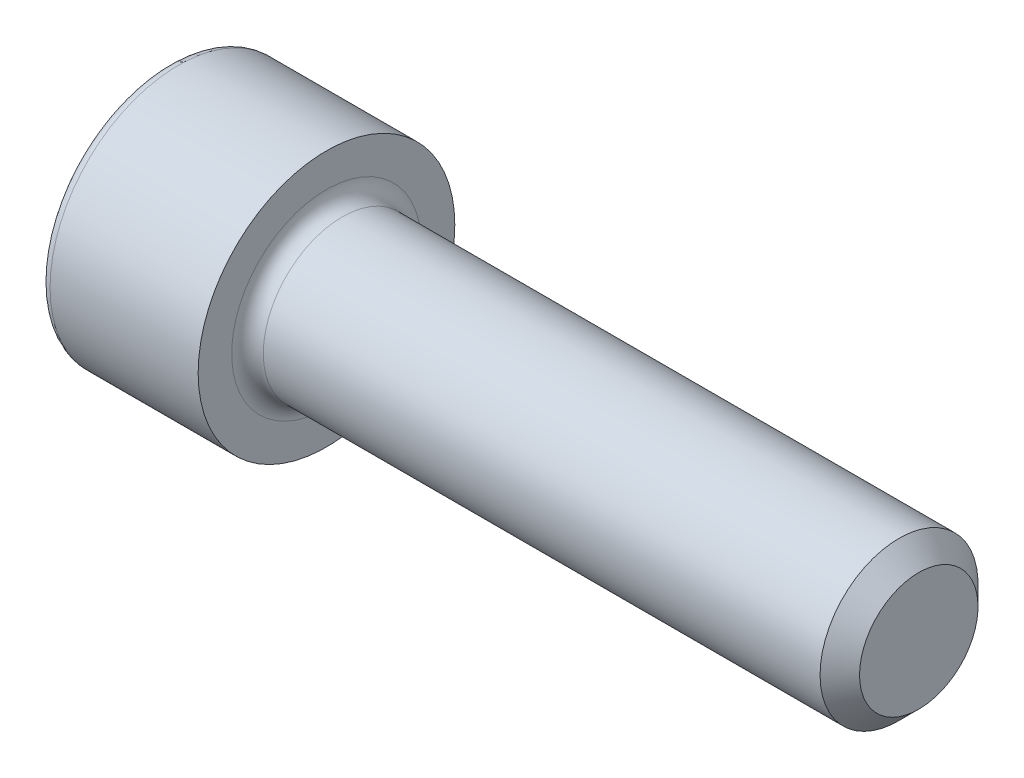
ISO-10303-21;
HEADER;
FILE_DESCRIPTION(('STEP AP214'),'2;1');
FILE_NAME('part.step','',(''),(''),'','','');
FILE_SCHEMA(('AUTOMOTIVE_DESIGN { 1 0 10303 214 1 1 1 1 }'));
ENDSEC;
DATA;
#1=APPLICATION_CONTEXT('core data for automotive mechanical design processes');
#2=APPLICATION_PROTOCOL_DEFINITION('international standard','automotive_design',2000,#1);
#3=PRODUCT_CONTEXT('',#1,'mechanical');
#4=PRODUCT('Part','Part','',(#3));
#5=PRODUCT_RELATED_PRODUCT_CATEGORY('part','',(#4));
#6=PRODUCT_DEFINITION_FORMATION('','',#4);
#7=PRODUCT_DEFINITION_CONTEXT('part definition',#1,'design');
#8=PRODUCT_DEFINITION('design','',#6,#7);
#9=PRODUCT_DEFINITION_SHAPE('','',#8);
#10=(LENGTH_UNIT() NAMED_UNIT(*) SI_UNIT(.MILLI.,.METRE.));
#11=(NAMED_UNIT(*) PLANE_ANGLE_UNIT() SI_UNIT($,.RADIAN.));
#12=(NAMED_UNIT(*) SI_UNIT($,.STERADIAN.) SOLID_ANGLE_UNIT());
#13=UNCERTAINTY_MEASURE_WITH_UNIT(LENGTH_MEASURE(1.E-05),#10,'distance_accuracy_value','');
#14=(GEOMETRIC_REPRESENTATION_CONTEXT(3) GLOBAL_UNCERTAINTY_ASSIGNED_CONTEXT((#13)) GLOBAL_UNIT_ASSIGNED_CONTEXT((#10,
#11,#12)) REPRESENTATION_CONTEXT('',''));
#15=CARTESIAN_POINT('',(0.,0.,0.));
#16=DIRECTION('',(0.,0.,1.));
#17=DIRECTION('',(1.,0.,0.));
#18=AXIS2_PLACEMENT_3D('',#15,#16,#17);
#19=CARTESIAN_POINT('',(0.,0.,0.));
#20=DIRECTION('',(-1.,0.,0.));
#21=DIRECTION('',(0.,0.,1.));
#22=AXIS2_PLACEMENT_3D('',#19,#20,#21);
#23=PLANE('',#22);
#24=DIRECTION('',(0.,-0.5,0.866025403784439));
#25=VECTOR('',#24,1.);
#26=CARTESIAN_POINT('',(0.,3.28800978303491,0.));
#27=LINE('',#26,#25);
#28=CARTESIAN_POINT('',(0.,3.28800978303491,0.));
#29=VERTEX_POINT('',#28);
#30=CARTESIAN_POINT('',(0.,1.64400489151746,2.8475));
#31=VERTEX_POINT('',#30);
#32=EDGE_CURVE('E265',#29,#31,#27,.T.);
#33=ORIENTED_EDGE('',*,*,#32,.T.);
#34=DIRECTION('',(0.,1.,0.));
#35=VECTOR('',#34,1.);
#36=CARTESIAN_POINT('',(0.,-1.64400489151746,2.8475));
#37=LINE('',#36,#35);
#38=CARTESIAN_POINT('',(0.,-1.64400489151746,2.8475));
#39=VERTEX_POINT('',#38);
#40=EDGE_CURVE('E137',#39,#31,#37,.T.);
#41=ORIENTED_EDGE('',*,*,#40,.F.);
#42=DIRECTION('',(0.,-0.500000000000001,-0.866025403784438));
#43=VECTOR('',#42,1.);
#44=CARTESIAN_POINT('',(0.,-1.64400489151746,2.8475));
#45=LINE('',#44,#43);
#46=CARTESIAN_POINT('',(0.,-3.28800978303493,0.));
#47=VERTEX_POINT('',#46);
#48=EDGE_CURVE('E268',#39,#47,#45,.T.);
#49=ORIENTED_EDGE('',*,*,#48,.T.);
#50=DIRECTION('',(0.,0.499999999999999,-0.866025403784439));
#51=VECTOR('',#50,1.);
#52=CARTESIAN_POINT('',(0.,-3.28800978303493,0.));
#53=LINE('',#52,#51);
#54=CARTESIAN_POINT('',(0.,-1.64400489151747,-2.8475));
#55=VERTEX_POINT('',#54);
#56=EDGE_CURVE('E271',#47,#55,#53,.T.);
#57=ORIENTED_EDGE('',*,*,#56,.T.);
#58=DIRECTION('',(0.,-1.,0.));
#59=VECTOR('',#58,1.);
#60=CARTESIAN_POINT('',(0.,1.64400489151745,-2.8475));
#61=LINE('',#60,#59);
#62=CARTESIAN_POINT('',(0.,1.64400489151745,-2.8475));
#63=VERTEX_POINT('',#62);
#64=EDGE_CURVE('E274',#63,#55,#61,.T.);
#65=ORIENTED_EDGE('',*,*,#64,.F.);
#66=DIRECTION('',(0.,-0.500000000000001,-0.866025403784438));
#67=VECTOR('',#66,1.);
#68=CARTESIAN_POINT('',(0.,3.28800978303491,0.));
#69=LINE('',#68,#67);
#70=EDGE_CURVE('E132',#29,#63,#69,.T.);
#71=ORIENTED_EDGE('',*,*,#70,.F.);
#72=EDGE_LOOP('',(#33,#41,#49,#57,#65,#71));
#73=FACE_BOUND('',#72,.T.);
#74=CARTESIAN_POINT('',(0.,0.,0.));
#75=DIRECTION('',(-1.,0.,0.));
#76=DIRECTION('',(0.,0.,1.));
#77=AXIS2_PLACEMENT_3D('',#74,#75,#76);
#78=CIRCLE('',#77,6.);
#79=CARTESIAN_POINT('',(0.,0.,6.));
#80=VERTEX_POINT('',#79);
#81=EDGE_CURVE('E49',#80,#80,#78,.T.);
#82=ORIENTED_EDGE('',*,*,#81,.T.);
#83=EDGE_LOOP('',(#82));
#84=FACE_BOUND('',#83,.T.);
#85=ADVANCED_FACE('F41',(#73,#84),#23,.T.);
#86=CARTESIAN_POINT('',(-31.75,0.,0.));
#87=DIRECTION('',(-1.,0.,0.));
#88=DIRECTION('',(0.,0.,1.));
#89=AXIS2_PLACEMENT_3D('',#86,#87,#88);
#90=CYLINDRICAL_SURFACE('',#89,6.5);
#91=CARTESIAN_POINT('',(0.5,0.,0.));
#92=DIRECTION('',(-1.,0.,0.));
#93=DIRECTION('',(0.,0.,1.));
#94=AXIS2_PLACEMENT_3D('',#91,#92,#93);
#95=CIRCLE('',#94,6.5);
#96=CARTESIAN_POINT('',(0.5,0.,6.5));
#97=VERTEX_POINT('',#96);
#98=EDGE_CURVE('E11',#97,#97,#95,.F.);
#99=ORIENTED_EDGE('',*,*,#98,.T.);
#100=EDGE_LOOP('',(#99));
#101=FACE_BOUND('',#100,.T.);
#102=CARTESIAN_POINT('',(8.,0.,0.));
#103=DIRECTION('',(-1.,0.,0.));
#104=DIRECTION('',(0.,0.,1.));
#105=AXIS2_PLACEMENT_3D('',#102,#103,#104);
#106=CIRCLE('',#105,6.5);
#107=CARTESIAN_POINT('',(8.,0.,6.5));
#108=VERTEX_POINT('',#107);
#109=EDGE_CURVE('E155',#108,#108,#106,.T.);
#110=ORIENTED_EDGE('',*,*,#109,.T.);
#111=EDGE_LOOP('',(#110));
#112=FACE_BOUND('',#111,.T.);
#113=ADVANCED_FACE('F179',(#101,#112),#90,.T.);
#114=CARTESIAN_POINT('',(8.,6.5,0.));
#115=DIRECTION('',(1.,0.,0.));
#116=DIRECTION('',(0.,0.,-1.));
#117=AXIS2_PLACEMENT_3D('',#114,#115,#116);
#118=PLANE('',#117);
#119=CARTESIAN_POINT('',(8.,0.,0.));
#120=DIRECTION('',(1.,0.,0.));
#121=DIRECTION('',(0.,0.,-1.));
#122=AXIS2_PLACEMENT_3D('',#119,#120,#121);
#123=CIRCLE('',#122,4.79999999999997);
#124=CARTESIAN_POINT('',(8.,0.,-4.79999999999997));
#125=VERTEX_POINT('',#124);
#126=EDGE_CURVE('E158',#125,#125,#123,.F.);
#127=ORIENTED_EDGE('',*,*,#126,.T.);
#128=EDGE_LOOP('',(#127));
#129=FACE_BOUND('',#128,.T.);
#130=ORIENTED_EDGE('',*,*,#109,.F.);
#131=EDGE_LOOP('',(#130));
#132=FACE_BOUND('',#131,.T.);
#133=ADVANCED_FACE('F185',(#129,#132),#118,.T.);
#134=CARTESIAN_POINT('',(-31.75,0.,0.));
#135=DIRECTION('',(-1.,0.,0.));
#136=DIRECTION('',(0.,0.,1.));
#137=AXIS2_PLACEMENT_3D('',#134,#135,#136);
#138=CYLINDRICAL_SURFACE('',#137,3.99999999999997);
#139=CARTESIAN_POINT('',(8.8,0.,0.));
#140=DIRECTION('',(1.,0.,0.));
#141=DIRECTION('',(0.,0.,-1.));
#142=AXIS2_PLACEMENT_3D('',#139,#140,#141);
#143=CIRCLE('',#142,3.99999999999997);
#144=CARTESIAN_POINT('',(8.8,0.,-3.99999999999997));
#145=VERTEX_POINT('',#144);
#146=EDGE_CURVE('E161',#145,#145,#143,.T.);
#147=ORIENTED_EDGE('',*,*,#146,.T.);
#148=EDGE_LOOP('',(#147));
#149=FACE_BOUND('',#148,.T.);
#150=CARTESIAN_POINT('',(37.,0.,0.));
#151=DIRECTION('',(-1.,0.,0.));
#152=DIRECTION('',(0.,0.,1.));
#153=AXIS2_PLACEMENT_3D('',#150,#151,#152);
#154=CIRCLE('',#153,3.99999999999995);
#155=CARTESIAN_POINT('',(37.,0.,3.99999999999995));
#156=VERTEX_POINT('',#155);
#157=EDGE_CURVE('E152',#156,#156,#154,.T.);
#158=ORIENTED_EDGE('',*,*,#157,.T.);
#159=EDGE_LOOP('',(#158));
#160=FACE_BOUND('',#159,.T.);
#161=ADVANCED_FACE('F191',(#149,#160),#138,.T.);
#162=CARTESIAN_POINT('',(38.,0.,0.));
#163=DIRECTION('',(-1.,0.,0.));
#164=DIRECTION('',(0.,0.,1.));
#165=AXIS2_PLACEMENT_3D('',#162,#163,#164);
#166=CONICAL_SURFACE('',#165,3.,0.785398163397421);
#167=ORIENTED_EDGE('',*,*,#157,.F.);
#168=EDGE_LOOP('',(#167));
#169=FACE_BOUND('',#168,.T.);
#170=CARTESIAN_POINT('',(38.,0.,0.));
#171=DIRECTION('',(-1.,0.,0.));
#172=DIRECTION('',(0.,0.,1.));
#173=AXIS2_PLACEMENT_3D('',#170,#171,#172);
#174=CIRCLE('',#173,3.);
#175=CARTESIAN_POINT('',(38.,0.,3.));
#176=VERTEX_POINT('',#175);
#177=EDGE_CURVE('E148',#176,#176,#174,.T.);
#178=ORIENTED_EDGE('',*,*,#177,.T.);
#179=EDGE_LOOP('',(#178));
#180=FACE_BOUND('',#179,.T.);
#181=ADVANCED_FACE('F195',(#169,#180),#166,.T.);
#182=CARTESIAN_POINT('',(38.,3.,0.));
#183=DIRECTION('',(1.,0.,0.));
#184=DIRECTION('',(0.,0.,-1.));
#185=AXIS2_PLACEMENT_3D('',#182,#183,#184);
#186=PLANE('',#185);
#187=ORIENTED_EDGE('',*,*,#177,.F.);
#188=EDGE_LOOP('',(#187));
#189=FACE_BOUND('',#188,.T.);
#190=ADVANCED_FACE('F175',(#189),#186,.T.);
#191=CARTESIAN_POINT('',(8.8,0.,0.));
#192=DIRECTION('',(1.,0.,0.));
#193=DIRECTION('',(0.,0.,-1.));
#194=AXIS2_PLACEMENT_3D('',#191,#192,#193);
#195=TOROIDAL_SURFACE('',#194,4.79999999999997,0.8);
#196=ORIENTED_EDGE('',*,*,#146,.F.);
#197=EDGE_LOOP('',(#196));
#198=FACE_BOUND('',#197,.T.);
#199=ORIENTED_EDGE('',*,*,#126,.F.);
#200=EDGE_LOOP('',(#199));
#201=FACE_BOUND('',#200,.T.);
#202=ADVANCED_FACE('F168',(#198,#201),#195,.F.);
#203=CARTESIAN_POINT('',(0.5,0.,0.));
#204=DIRECTION('',(-1.,0.,0.));
#205=DIRECTION('',(0.,0.,1.));
#206=AXIS2_PLACEMENT_3D('',#203,#204,#205);
#207=TOROIDAL_SURFACE('',#206,6.,0.5);
#208=ORIENTED_EDGE('',*,*,#98,.F.);
#209=EDGE_LOOP('',(#208));
#210=FACE_BOUND('',#209,.T.);
#211=ORIENTED_EDGE('',*,*,#81,.F.);
#212=EDGE_LOOP('',(#211));
#213=FACE_BOUND('',#212,.T.);
#214=ADVANCED_FACE('F43',(#210,#213),#207,.T.);
#215=CARTESIAN_POINT('',(12.573,3.28800978303491,0.));
#216=DIRECTION('',(0.,-0.866025403784439,-0.5));
#217=DIRECTION('',(0.,0.5,-0.866025403784439));
#218=AXIS2_PLACEMENT_3D('',#215,#216,#217);
#219=PLANE('',#218);
#220=ORIENTED_EDGE('',*,*,#32,.F.);
#221=DIRECTION('',(-1.,0.,0.));
#222=VECTOR('',#221,1.);
#223=CARTESIAN_POINT('',(12.573,3.28800978303491,0.));
#224=LINE('',#223,#222);
#225=CARTESIAN_POINT('',(12.573,3.28800978303491,0.));
#226=VERTEX_POINT('',#225);
#227=EDGE_CURVE('E255',#226,#29,#224,.T.);
#228=ORIENTED_EDGE('',*,*,#227,.F.);
#229=DIRECTION('',(0.,-0.5,0.866025403784439));
#230=VECTOR('',#229,1.);
#231=CARTESIAN_POINT('',(12.573,3.28800978303491,0.));
#232=LINE('',#231,#230);
#233=CARTESIAN_POINT('',(12.573,2.46600733727619,1.42375));
#234=VERTEX_POINT('',#233);
#235=EDGE_CURVE('E124',#226,#234,#232,.T.);
#236=ORIENTED_EDGE('',*,*,#235,.T.);
#237=CARTESIAN_POINT('',(12.573,1.64400489151746,2.8475));
#238=VERTEX_POINT('',#237);
#239=EDGE_CURVE('E115',#234,#238,#232,.T.);
#240=ORIENTED_EDGE('',*,*,#239,.T.);
#241=DIRECTION('',(-1.,0.,0.));
#242=VECTOR('',#241,1.);
#243=CARTESIAN_POINT('',(12.573,1.64400489151746,2.8475));
#244=LINE('',#243,#242);
#245=EDGE_CURVE('E129',#238,#31,#244,.T.);
#246=ORIENTED_EDGE('',*,*,#245,.T.);
#247=EDGE_LOOP('',(#220,#228,#236,#240,#246));
#248=FACE_BOUND('',#247,.T.);
#249=ADVANCED_FACE('F128',(#248),#219,.T.);
#250=CARTESIAN_POINT('',(12.573,-1.64400489151746,2.8475));
#251=DIRECTION('',(0.,0.,1.));
#252=DIRECTION('',(0.,-1.,0.));
#253=AXIS2_PLACEMENT_3D('',#250,#251,#252);
#254=PLANE('',#253);
#255=ORIENTED_EDGE('',*,*,#40,.T.);
#256=ORIENTED_EDGE('',*,*,#245,.F.);
#257=DIRECTION('',(0.,1.,0.));
#258=VECTOR('',#257,1.);
#259=CARTESIAN_POINT('',(12.573,-1.64400489151746,2.8475));
#260=LINE('',#259,#258);
#261=CARTESIAN_POINT('',(12.573,0.,2.8475));
#262=VERTEX_POINT('',#261);
#263=EDGE_CURVE('E112',#262,#238,#260,.T.);
#264=ORIENTED_EDGE('',*,*,#263,.F.);
#265=CARTESIAN_POINT('',(12.573,-1.64400489151746,2.8475));
#266=VERTEX_POINT('',#265);
#267=EDGE_CURVE('E123',#266,#262,#260,.T.);
#268=ORIENTED_EDGE('',*,*,#267,.F.);
#269=DIRECTION('',(-1.,0.,0.));
#270=VECTOR('',#269,1.);
#271=CARTESIAN_POINT('',(12.573,-1.64400489151746,2.8475));
#272=LINE('',#271,#270);
#273=EDGE_CURVE('E139',#266,#39,#272,.T.);
#274=ORIENTED_EDGE('',*,*,#273,.T.);
#275=EDGE_LOOP('',(#255,#256,#264,#268,#274));
#276=FACE_BOUND('',#275,.T.);
#277=ADVANCED_FACE('F134',(#276),#254,.F.);
#278=CARTESIAN_POINT('',(12.573,-1.64400489151746,2.8475));
#279=DIRECTION('',(0.,0.866025403784438,-0.500000000000001));
#280=DIRECTION('',(0.,0.500000000000001,0.866025403784438));
#281=AXIS2_PLACEMENT_3D('',#278,#279,#280);
#282=PLANE('',#281);
#283=ORIENTED_EDGE('',*,*,#48,.F.);
#284=ORIENTED_EDGE('',*,*,#273,.F.);
#285=DIRECTION('',(0.,-0.500000000000001,-0.866025403784438));
#286=VECTOR('',#285,1.);
#287=CARTESIAN_POINT('',(12.573,-1.64400489151746,2.8475));
#288=LINE('',#287,#286);
#289=CARTESIAN_POINT('',(12.573,-2.46600733727619,1.42375000000001));
#290=VERTEX_POINT('',#289);
#291=EDGE_CURVE('E294',#266,#290,#288,.T.);
#292=ORIENTED_EDGE('',*,*,#291,.T.);
#293=CARTESIAN_POINT('',(12.573,-3.28800978303493,0.));
#294=VERTEX_POINT('',#293);
#295=EDGE_CURVE('E283',#290,#294,#288,.T.);
#296=ORIENTED_EDGE('',*,*,#295,.T.);
#297=DIRECTION('',(-1.,0.,0.));
#298=VECTOR('',#297,1.);
#299=CARTESIAN_POINT('',(12.573,-3.28800978303493,0.));
#300=LINE('',#299,#298);
#301=EDGE_CURVE('E144',#294,#47,#300,.T.);
#302=ORIENTED_EDGE('',*,*,#301,.T.);
#303=EDGE_LOOP('',(#283,#284,#292,#296,#302));
#304=FACE_BOUND('',#303,.T.);
#305=ADVANCED_FACE('F209',(#304),#282,.T.);
#306=CARTESIAN_POINT('',(12.573,-3.28800978303493,0.));
#307=DIRECTION('',(0.,0.866025403784439,0.5));
#308=DIRECTION('',(0.,-0.5,0.866025403784439));
#309=AXIS2_PLACEMENT_3D('',#306,#307,#308);
#310=PLANE('',#309);
#311=ORIENTED_EDGE('',*,*,#56,.F.);
#312=ORIENTED_EDGE('',*,*,#301,.F.);
#313=DIRECTION('',(0.,0.499999999999999,-0.866025403784439));
#314=VECTOR('',#313,1.);
#315=CARTESIAN_POINT('',(12.573,-3.28800978303493,0.));
#316=LINE('',#315,#314);
#317=CARTESIAN_POINT('',(12.573,-2.46600733727619,-1.42375));
#318=VERTEX_POINT('',#317);
#319=EDGE_CURVE('E261',#294,#318,#316,.T.);
#320=ORIENTED_EDGE('',*,*,#319,.T.);
#321=CARTESIAN_POINT('',(12.573,-1.64400489151747,-2.8475));
#322=VERTEX_POINT('',#321);
#323=EDGE_CURVE('E293',#318,#322,#316,.T.);
#324=ORIENTED_EDGE('',*,*,#323,.T.);
#325=DIRECTION('',(-1.,0.,0.));
#326=VECTOR('',#325,1.);
#327=CARTESIAN_POINT('',(12.573,-1.64400489151747,-2.8475));
#328=LINE('',#327,#326);
#329=EDGE_CURVE('E254',#322,#55,#328,.T.);
#330=ORIENTED_EDGE('',*,*,#329,.T.);
#331=EDGE_LOOP('',(#311,#312,#320,#324,#330));
#332=FACE_BOUND('',#331,.T.);
#333=ADVANCED_FACE('F212',(#332),#310,.T.);
#334=CARTESIAN_POINT('',(12.573,1.64400489151745,-2.8475));
#335=DIRECTION('',(0.,0.,-1.));
#336=DIRECTION('',(0.,1.,0.));
#337=AXIS2_PLACEMENT_3D('',#334,#335,#336);
#338=PLANE('',#337);
#339=ORIENTED_EDGE('',*,*,#64,.T.);
#340=ORIENTED_EDGE('',*,*,#329,.F.);
#341=DIRECTION('',(0.,-1.,0.));
#342=VECTOR('',#341,1.);
#343=CARTESIAN_POINT('',(12.573,1.64400489151745,-2.8475));
#344=LINE('',#343,#342);
#345=CARTESIAN_POINT('',(12.573,0.,-2.8475));
#346=VERTEX_POINT('',#345);
#347=EDGE_CURVE('E258',#346,#322,#344,.T.);
#348=ORIENTED_EDGE('',*,*,#347,.F.);
#349=CARTESIAN_POINT('',(12.573,1.64400489151745,-2.8475));
#350=VERTEX_POINT('',#349);
#351=EDGE_CURVE('E56',#350,#346,#344,.T.);
#352=ORIENTED_EDGE('',*,*,#351,.F.);
#353=DIRECTION('',(-1.,0.,0.));
#354=VECTOR('',#353,1.);
#355=CARTESIAN_POINT('',(12.573,1.64400489151745,-2.8475));
#356=LINE('',#355,#354);
#357=EDGE_CURVE('E251',#350,#63,#356,.T.);
#358=ORIENTED_EDGE('',*,*,#357,.T.);
#359=EDGE_LOOP('',(#339,#340,#348,#352,#358));
#360=FACE_BOUND('',#359,.T.);
#361=ADVANCED_FACE('F216',(#360),#338,.F.);
#362=CARTESIAN_POINT('',(12.573,3.28800978303491,0.));
#363=DIRECTION('',(0.,0.866025403784438,-0.500000000000001));
#364=DIRECTION('',(0.,0.500000000000001,0.866025403784438));
#365=AXIS2_PLACEMENT_3D('',#362,#363,#364);
#366=PLANE('',#365);
#367=ORIENTED_EDGE('',*,*,#70,.T.);
#368=ORIENTED_EDGE('',*,*,#357,.F.);
#369=DIRECTION('',(0.,-0.500000000000001,-0.866025403784438));
#370=VECTOR('',#369,1.);
#371=CARTESIAN_POINT('',(12.573,3.28800978303491,0.));
#372=LINE('',#371,#370);
#373=CARTESIAN_POINT('',(12.573,2.46600733727618,-1.42375));
#374=VERTEX_POINT('',#373);
#375=EDGE_CURVE('E241',#374,#350,#372,.T.);
#376=ORIENTED_EDGE('',*,*,#375,.F.);
#377=EDGE_CURVE('E247',#226,#374,#372,.T.);
#378=ORIENTED_EDGE('',*,*,#377,.F.);
#379=ORIENTED_EDGE('',*,*,#227,.T.);
#380=EDGE_LOOP('',(#367,#368,#376,#378,#379));
#381=FACE_BOUND('',#380,.T.);
#382=ADVANCED_FACE('F220',(#381),#366,.F.);
#383=CARTESIAN_POINT('',(12.573,3.28800978303491,0.));
#384=DIRECTION('',(1.,0.,0.));
#385=DIRECTION('',(0.,0.,-1.));
#386=AXIS2_PLACEMENT_3D('',#383,#384,#385);
#387=PLANE('',#386);
#388=ORIENTED_EDGE('',*,*,#347,.T.);
#389=ORIENTED_EDGE('',*,*,#323,.F.);
#390=CARTESIAN_POINT('',(12.573,0.,0.));
#391=DIRECTION('',(-1.,0.,0.));
#392=DIRECTION('',(0.,0.,1.));
#393=AXIS2_PLACEMENT_3D('',#390,#391,#392);
#394=CIRCLE('',#393,2.8475);
#395=EDGE_CURVE('E289',#346,#318,#394,.T.);
#396=ORIENTED_EDGE('',*,*,#395,.F.);
#397=EDGE_LOOP('',(#388,#389,#396));
#398=FACE_BOUND('',#397,.T.);
#399=ADVANCED_FACE('F224',(#398),#387,.F.);
#400=ORIENTED_EDGE('',*,*,#319,.F.);
#401=ORIENTED_EDGE('',*,*,#295,.F.);
#402=EDGE_CURVE('E142',#318,#290,#394,.T.);
#403=ORIENTED_EDGE('',*,*,#402,.F.);
#404=EDGE_LOOP('',(#400,#401,#403));
#405=FACE_BOUND('',#404,.T.);
#406=ADVANCED_FACE('F227',(#405),#387,.F.);
#407=ORIENTED_EDGE('',*,*,#291,.F.);
#408=ORIENTED_EDGE('',*,*,#267,.T.);
#409=EDGE_CURVE('E138',#290,#262,#394,.T.);
#410=ORIENTED_EDGE('',*,*,#409,.F.);
#411=EDGE_LOOP('',(#407,#408,#410));
#412=FACE_BOUND('',#411,.T.);
#413=ADVANCED_FACE('F232',(#412),#387,.F.);
#414=ORIENTED_EDGE('',*,*,#263,.T.);
#415=ORIENTED_EDGE('',*,*,#239,.F.);
#416=EDGE_CURVE('E118',#262,#234,#394,.T.);
#417=ORIENTED_EDGE('',*,*,#416,.F.);
#418=EDGE_LOOP('',(#414,#415,#417));
#419=FACE_BOUND('',#418,.T.);
#420=ADVANCED_FACE('F114',(#419),#387,.F.);
#421=ORIENTED_EDGE('',*,*,#235,.F.);
#422=ORIENTED_EDGE('',*,*,#377,.T.);
#423=EDGE_CURVE('E149',#234,#374,#394,.T.);
#424=ORIENTED_EDGE('',*,*,#423,.F.);
#425=EDGE_LOOP('',(#421,#422,#424));
#426=FACE_BOUND('',#425,.T.);
#427=ADVANCED_FACE('F235',(#426),#387,.F.);
#428=ORIENTED_EDGE('',*,*,#375,.T.);
#429=ORIENTED_EDGE('',*,*,#351,.T.);
#430=EDGE_CURVE('E244',#374,#346,#394,.T.);
#431=ORIENTED_EDGE('',*,*,#430,.F.);
#432=EDGE_LOOP('',(#428,#429,#431));
#433=FACE_BOUND('',#432,.T.);
#434=ADVANCED_FACE('F205',(#433),#387,.F.);
#435=CARTESIAN_POINT('',(12.573,0.,0.));
#436=DIRECTION('',(-1.,0.,0.));
#437=DIRECTION('',(0.,0.,1.));
#438=AXIS2_PLACEMENT_3D('',#435,#436,#437);
#439=CONICAL_SURFACE('',#438,2.8475,1.04719755119659);
#440=CARTESIAN_POINT('',(14.2170048915175,0.,0.));
#441=VERTEX_POINT('',#440);
#442=VERTEX_LOOP('',#441);
#443=FACE_BOUND('',#442,.T.);
#444=ORIENTED_EDGE('',*,*,#416,.T.);
#445=ORIENTED_EDGE('',*,*,#423,.T.);
#446=ORIENTED_EDGE('',*,*,#430,.T.);
#447=ORIENTED_EDGE('',*,*,#395,.T.);
#448=ORIENTED_EDGE('',*,*,#402,.T.);
#449=ORIENTED_EDGE('',*,*,#409,.T.);
#450=EDGE_LOOP('',(#444,#445,#446,#447,#448,#449));
#451=FACE_BOUND('',#450,.T.);
#452=ADVANCED_FACE('F203',(#443,#451),#439,.F.);
#453=CLOSED_SHELL('',(#85,#113,#133,#161,#181,#190,#202,#214,#249,#277,#305,#333,#361,#382,#399,
#406,#413,#420,#427,#434,#452));
#454=MANIFOLD_SOLID_BREP('B2',#453);
#455=ADVANCED_BREP_SHAPE_REPRESENTATION('',(#18,#454),#14);
#456=SHAPE_DEFINITION_REPRESENTATION(#9,#455);
ENDSEC;
END-ISO-10303-21;
